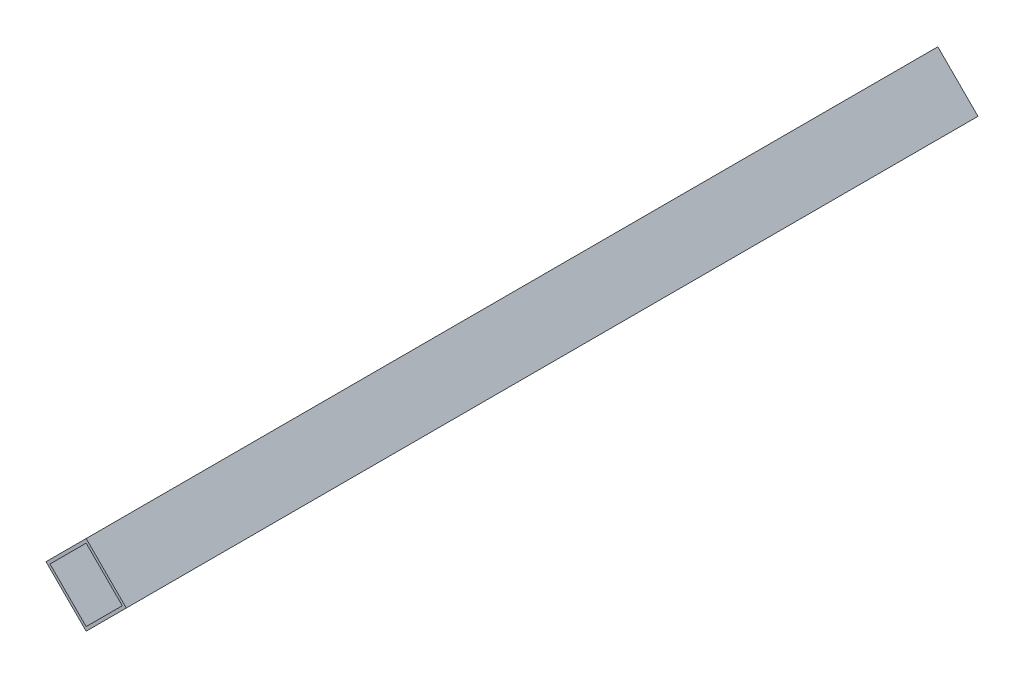
ISO-10303-21;
HEADER;
FILE_DESCRIPTION(('STEP AP214'),'2;1');
FILE_NAME('part.step','',(''),(''),'','','');
FILE_SCHEMA(('AUTOMOTIVE_DESIGN { 1 0 10303 214 1 1 1 1 }'));
ENDSEC;
DATA;
#1=APPLICATION_CONTEXT('core data for automotive mechanical design processes');
#2=APPLICATION_PROTOCOL_DEFINITION('international standard','automotive_design',2000,#1);
#3=PRODUCT_CONTEXT('',#1,'mechanical');
#4=PRODUCT('Part','Part','',(#3));
#5=PRODUCT_RELATED_PRODUCT_CATEGORY('part','',(#4));
#6=PRODUCT_DEFINITION_FORMATION('','',#4);
#7=PRODUCT_DEFINITION_CONTEXT('part definition',#1,'design');
#8=PRODUCT_DEFINITION('design','',#6,#7);
#9=PRODUCT_DEFINITION_SHAPE('','',#8);
#10=(LENGTH_UNIT() NAMED_UNIT(*) SI_UNIT(.MILLI.,.METRE.));
#11=(NAMED_UNIT(*) PLANE_ANGLE_UNIT() SI_UNIT($,.RADIAN.));
#12=(NAMED_UNIT(*) SI_UNIT($,.STERADIAN.) SOLID_ANGLE_UNIT());
#13=UNCERTAINTY_MEASURE_WITH_UNIT(LENGTH_MEASURE(1.E-05),#10,'distance_accuracy_value','');
#14=(GEOMETRIC_REPRESENTATION_CONTEXT(3) GLOBAL_UNCERTAINTY_ASSIGNED_CONTEXT((#13)) GLOBAL_UNIT_ASSIGNED_CONTEXT((#10,
#11,#12)) REPRESENTATION_CONTEXT('',''));
#15=CARTESIAN_POINT('',(0.,0.,0.));
#16=DIRECTION('',(0.,0.,1.));
#17=DIRECTION('',(1.,0.,0.));
#18=AXIS2_PLACEMENT_3D('',#15,#16,#17);
#19=CARTESIAN_POINT('',(0.,0.,300.));
#20=DIRECTION('',(0.,0.,1.));
#21=DIRECTION('',(1.,0.,0.));
#22=AXIS2_PLACEMENT_3D('',#19,#20,#21);
#23=PLANE('',#22);
#24=DIRECTION('',(0.707106781186544,0.707106781186551,0.));
#25=VECTOR('',#24,1.);
#26=CARTESIAN_POINT('',(1.472650518087E-13,-14.1421356237309,300.));
#27=LINE('',#26,#25);
#28=CARTESIAN_POINT('',(1.472650518087E-13,-14.1421356237309,300.));
#29=VERTEX_POINT('',#28);
#30=CARTESIAN_POINT('',(14.1421356237309,0.,300.));
#31=VERTEX_POINT('',#30);
#32=EDGE_CURVE('E140',#29,#31,#27,.T.);
#33=ORIENTED_EDGE('',*,*,#32,.T.);
#34=DIRECTION('',(-0.707106781186549,0.707106781186546,0.));
#35=VECTOR('',#34,1.);
#36=CARTESIAN_POINT('',(14.1421356237309,0.,300.));
#37=LINE('',#36,#35);
#38=CARTESIAN_POINT('',(0.,14.1421356237309,300.));
#39=VERTEX_POINT('',#38);
#40=EDGE_CURVE('E143',#31,#39,#37,.T.);
#41=ORIENTED_EDGE('',*,*,#40,.T.);
#42=DIRECTION('',(-0.707106781186544,-0.707106781186551,0.));
#43=VECTOR('',#42,1.);
#44=CARTESIAN_POINT('',(0.,14.1421356237309,300.));
#45=LINE('',#44,#43);
#46=CARTESIAN_POINT('',(-14.1421356237309,0.,300.));
#47=VERTEX_POINT('',#46);
#48=EDGE_CURVE('E146',#39,#47,#45,.T.);
#49=ORIENTED_EDGE('',*,*,#48,.T.);
#50=DIRECTION('',(0.707106781186554,-0.707106781186541,0.));
#51=VECTOR('',#50,1.);
#52=CARTESIAN_POINT('',(-14.1421356237309,0.,300.));
#53=LINE('',#52,#51);
#54=EDGE_CURVE('E148',#47,#29,#53,.T.);
#55=ORIENTED_EDGE('',*,*,#54,.T.);
#56=EDGE_LOOP('',(#33,#41,#49,#55));
#57=FACE_BOUND('',#56,.T.);
#58=DIRECTION('',(-0.707106781186544,0.707106781186551,0.));
#59=VECTOR('',#58,1.);
#60=CARTESIAN_POINT('',(12.7279220613579,0.,300.));
#61=LINE('',#60,#59);
#62=CARTESIAN_POINT('',(12.7279220613579,0.,300.));
#63=VERTEX_POINT('',#62);
#64=CARTESIAN_POINT('',(0.,12.7279220613578,300.));
#65=VERTEX_POINT('',#64);
#66=EDGE_CURVE('E110',#63,#65,#61,.T.);
#67=ORIENTED_EDGE('',*,*,#66,.F.);
#68=DIRECTION('',(0.707106781186552,0.707106781186543,0.));
#69=VECTOR('',#68,1.);
#70=CARTESIAN_POINT('',(0.,-12.7279220613579,300.));
#71=LINE('',#70,#69);
#72=CARTESIAN_POINT('',(0.,-12.7279220613579,300.));
#73=VERTEX_POINT('',#72);
#74=EDGE_CURVE('E102',#73,#63,#71,.T.);
#75=ORIENTED_EDGE('',*,*,#74,.F.);
#76=DIRECTION('',(0.707106781186543,-0.707106781186552,0.));
#77=VECTOR('',#76,1.);
#78=CARTESIAN_POINT('',(-12.7279220613578,0.,300.));
#79=LINE('',#78,#77);
#80=CARTESIAN_POINT('',(-12.7279220613578,0.,300.));
#81=VERTEX_POINT('',#80);
#82=EDGE_CURVE('E124',#81,#73,#79,.T.);
#83=ORIENTED_EDGE('',*,*,#82,.F.);
#84=DIRECTION('',(-0.707106781186552,-0.707106781186544,0.));
#85=VECTOR('',#84,1.);
#86=CARTESIAN_POINT('',(0.,12.7279220613578,300.));
#87=LINE('',#86,#85);
#88=EDGE_CURVE('E122',#65,#81,#87,.T.);
#89=ORIENTED_EDGE('',*,*,#88,.F.);
#90=EDGE_LOOP('',(#67,#75,#83,#89));
#91=FACE_BOUND('',#90,.T.);
#92=ADVANCED_FACE('F35',(#57,#91),#23,.T.);
#93=CARTESIAN_POINT('',(0.,0.,0.));
#94=DIRECTION('',(0.,0.,1.));
#95=DIRECTION('',(1.,0.,0.));
#96=AXIS2_PLACEMENT_3D('',#93,#94,#95);
#97=PLANE('',#96);
#98=DIRECTION('',(0.707106781186544,0.707106781186551,0.));
#99=VECTOR('',#98,1.);
#100=CARTESIAN_POINT('',(1.472650518087E-13,-14.1421356237309,0.));
#101=LINE('',#100,#99);
#102=CARTESIAN_POINT('',(1.472650518087E-13,-14.1421356237309,0.));
#103=VERTEX_POINT('',#102);
#104=CARTESIAN_POINT('',(14.1421356237309,0.,0.));
#105=VERTEX_POINT('',#104);
#106=EDGE_CURVE('E118',#103,#105,#101,.T.);
#107=ORIENTED_EDGE('',*,*,#106,.F.);
#108=DIRECTION('',(0.707106781186554,-0.707106781186541,0.));
#109=VECTOR('',#108,1.);
#110=CARTESIAN_POINT('',(-14.1421356237309,0.,0.));
#111=LINE('',#110,#109);
#112=CARTESIAN_POINT('',(-14.1421356237309,0.,0.));
#113=VERTEX_POINT('',#112);
#114=EDGE_CURVE('E144',#113,#103,#111,.T.);
#115=ORIENTED_EDGE('',*,*,#114,.F.);
#116=DIRECTION('',(-0.707106781186544,-0.707106781186551,0.));
#117=VECTOR('',#116,1.);
#118=CARTESIAN_POINT('',(0.,14.1421356237309,0.));
#119=LINE('',#118,#117);
#120=CARTESIAN_POINT('',(0.,14.1421356237309,0.));
#121=VERTEX_POINT('',#120);
#122=EDGE_CURVE('E155',#121,#113,#119,.T.);
#123=ORIENTED_EDGE('',*,*,#122,.F.);
#124=DIRECTION('',(-0.707106781186549,0.707106781186546,0.));
#125=VECTOR('',#124,1.);
#126=CARTESIAN_POINT('',(14.1421356237309,0.,0.));
#127=LINE('',#126,#125);
#128=EDGE_CURVE('E153',#105,#121,#127,.T.);
#129=ORIENTED_EDGE('',*,*,#128,.F.);
#130=EDGE_LOOP('',(#107,#115,#123,#129));
#131=FACE_BOUND('',#130,.T.);
#132=DIRECTION('',(0.707106781186552,0.707106781186543,0.));
#133=VECTOR('',#132,1.);
#134=CARTESIAN_POINT('',(0.,-12.7279220613579,0.));
#135=LINE('',#134,#133);
#136=CARTESIAN_POINT('',(0.,-12.7279220613579,0.));
#137=VERTEX_POINT('',#136);
#138=CARTESIAN_POINT('',(12.7279220613579,0.,0.));
#139=VERTEX_POINT('',#138);
#140=EDGE_CURVE('E60',#137,#139,#135,.T.);
#141=ORIENTED_EDGE('',*,*,#140,.T.);
#142=DIRECTION('',(-0.707106781186544,0.707106781186551,0.));
#143=VECTOR('',#142,1.);
#144=CARTESIAN_POINT('',(12.7279220613579,0.,0.));
#145=LINE('',#144,#143);
#146=CARTESIAN_POINT('',(0.,12.7279220613578,0.));
#147=VERTEX_POINT('',#146);
#148=EDGE_CURVE('E117',#139,#147,#145,.T.);
#149=ORIENTED_EDGE('',*,*,#148,.T.);
#150=DIRECTION('',(-0.707106781186552,-0.707106781186544,0.));
#151=VECTOR('',#150,1.);
#152=CARTESIAN_POINT('',(0.,12.7279220613578,0.));
#153=LINE('',#152,#151);
#154=CARTESIAN_POINT('',(-12.7279220613578,0.,0.));
#155=VERTEX_POINT('',#154);
#156=EDGE_CURVE('E132',#147,#155,#153,.T.);
#157=ORIENTED_EDGE('',*,*,#156,.T.);
#158=DIRECTION('',(0.707106781186543,-0.707106781186552,0.));
#159=VECTOR('',#158,1.);
#160=CARTESIAN_POINT('',(-12.7279220613578,0.,0.));
#161=LINE('',#160,#159);
#162=EDGE_CURVE('E111',#155,#137,#161,.T.);
#163=ORIENTED_EDGE('',*,*,#162,.T.);
#164=EDGE_LOOP('',(#141,#149,#157,#163));
#165=FACE_BOUND('',#164,.T.);
#166=ADVANCED_FACE('F228',(#131,#165),#97,.F.);
#167=CARTESIAN_POINT('',(1.472650518087E-13,-14.1421356237309,300.));
#168=DIRECTION('',(-0.707106781186551,0.707106781186544,0.));
#169=DIRECTION('',(-0.707106781186544,-0.707106781186551,0.));
#170=AXIS2_PLACEMENT_3D('',#167,#168,#169);
#171=PLANE('',#170);
#172=CARTESIAN_POINT('',(7.07106781186554,-7.07106781186546,290.));
#173=DIRECTION('',(0.707106781186551,-0.707106781186544,0.));
#174=DIRECTION('',(0.707106781186544,0.707106781186551,0.));
#175=AXIS2_PLACEMENT_3D('',#172,#173,#174);
#176=CIRCLE('',#175,0.999999999999998);
#177=CARTESIAN_POINT('',(7.77817459305208,-6.36396103067891,290.));
#178=VERTEX_POINT('',#177);
#179=EDGE_CURVE('E169',#178,#178,#176,.T.);
#180=ORIENTED_EDGE('',*,*,#179,.F.);
#181=EDGE_LOOP('',(#180));
#182=FACE_BOUND('',#181,.T.);
#183=CARTESIAN_POINT('',(7.07106781186554,-7.07106781186546,220.));
#184=DIRECTION('',(0.707106781186551,-0.707106781186544,0.));
#185=DIRECTION('',(0.707106781186544,0.707106781186551,0.));
#186=AXIS2_PLACEMENT_3D('',#183,#184,#185);
#187=CIRCLE('',#186,0.999999999999998);
#188=CARTESIAN_POINT('',(7.77817459305208,-6.36396103067891,220.));
#189=VERTEX_POINT('',#188);
#190=EDGE_CURVE('E329',#189,#189,#187,.T.);
#191=ORIENTED_EDGE('',*,*,#190,.F.);
#192=EDGE_LOOP('',(#191));
#193=FACE_BOUND('',#192,.T.);
#194=CARTESIAN_POINT('',(7.07106781186554,-7.07106781186546,150.));
#195=DIRECTION('',(0.707106781186551,-0.707106781186544,0.));
#196=DIRECTION('',(0.707106781186544,0.707106781186551,0.));
#197=AXIS2_PLACEMENT_3D('',#194,#195,#196);
#198=CIRCLE('',#197,0.999999999999998);
#199=CARTESIAN_POINT('',(7.77817459305208,-6.36396103067891,150.));
#200=VERTEX_POINT('',#199);
#201=EDGE_CURVE('E327',#200,#200,#198,.T.);
#202=ORIENTED_EDGE('',*,*,#201,.F.);
#203=EDGE_LOOP('',(#202));
#204=FACE_BOUND('',#203,.T.);
#205=CARTESIAN_POINT('',(7.07106781186554,-7.07106781186546,80.));
#206=DIRECTION('',(0.707106781186551,-0.707106781186544,0.));
#207=DIRECTION('',(0.707106781186544,0.707106781186551,0.));
#208=AXIS2_PLACEMENT_3D('',#205,#206,#207);
#209=CIRCLE('',#208,0.999999999999998);
#210=CARTESIAN_POINT('',(7.77817459305208,-6.36396103067891,80.));
#211=VERTEX_POINT('',#210);
#212=EDGE_CURVE('E325',#211,#211,#209,.T.);
#213=ORIENTED_EDGE('',*,*,#212,.F.);
#214=EDGE_LOOP('',(#213));
#215=FACE_BOUND('',#214,.T.);
#216=CARTESIAN_POINT('',(7.07106781186554,-7.07106781186546,9.99999999999995));
#217=DIRECTION('',(0.707106781186551,-0.707106781186544,0.));
#218=DIRECTION('',(0.707106781186544,0.707106781186551,0.));
#219=AXIS2_PLACEMENT_3D('',#216,#217,#218);
#220=CIRCLE('',#219,0.999999999999998);
#221=CARTESIAN_POINT('',(7.77817459305208,-6.36396103067891,9.99999999999995));
#222=VERTEX_POINT('',#221);
#223=EDGE_CURVE('E300',#222,#222,#220,.T.);
#224=ORIENTED_EDGE('',*,*,#223,.F.);
#225=EDGE_LOOP('',(#224));
#226=FACE_BOUND('',#225,.T.);
#227=ORIENTED_EDGE('',*,*,#106,.T.);
#228=DIRECTION('',(0.,0.,-1.));
#229=VECTOR('',#228,1.);
#230=CARTESIAN_POINT('',(14.1421356237309,0.,300.));
#231=LINE('',#230,#229);
#232=EDGE_CURVE('E11',#31,#105,#231,.T.);
#233=ORIENTED_EDGE('',*,*,#232,.F.);
#234=ORIENTED_EDGE('',*,*,#32,.F.);
#235=DIRECTION('',(0.,0.,-1.));
#236=VECTOR('',#235,1.);
#237=CARTESIAN_POINT('',(1.472650518087E-13,-14.1421356237309,300.));
#238=LINE('',#237,#236);
#239=EDGE_CURVE('E150',#29,#103,#238,.T.);
#240=ORIENTED_EDGE('',*,*,#239,.T.);
#241=EDGE_LOOP('',(#227,#233,#234,#240));
#242=FACE_BOUND('',#241,.T.);
#243=ADVANCED_FACE('F37',(#182,#193,#204,#215,#226,#242),#171,.F.);
#244=CARTESIAN_POINT('',(14.1421356237309,0.,300.));
#245=DIRECTION('',(-0.707106781186546,-0.707106781186549,0.));
#246=DIRECTION('',(0.707106781186549,-0.707106781186546,0.));
#247=AXIS2_PLACEMENT_3D('',#244,#245,#246);
#248=PLANE('',#247);
#249=ORIENTED_EDGE('',*,*,#128,.T.);
#250=DIRECTION('',(0.,0.,-1.));
#251=VECTOR('',#250,1.);
#252=CARTESIAN_POINT('',(0.,14.1421356237309,300.));
#253=LINE('',#252,#251);
#254=EDGE_CURVE('E44',#39,#121,#253,.T.);
#255=ORIENTED_EDGE('',*,*,#254,.F.);
#256=ORIENTED_EDGE('',*,*,#40,.F.);
#257=ORIENTED_EDGE('',*,*,#232,.T.);
#258=EDGE_LOOP('',(#249,#255,#256,#257));
#259=FACE_BOUND('',#258,.T.);
#260=ADVANCED_FACE('F244',(#259),#248,.F.);
#261=CARTESIAN_POINT('',(0.,14.1421356237309,300.));
#262=DIRECTION('',(0.707106781186551,-0.707106781186544,0.));
#263=DIRECTION('',(0.707106781186544,0.707106781186551,0.));
#264=AXIS2_PLACEMENT_3D('',#261,#262,#263);
#265=PLANE('',#264);
#266=CARTESIAN_POINT('',(-7.07106781186549,7.07106781186541,290.));
#267=DIRECTION('',(0.707106781186551,-0.707106781186544,0.));
#268=DIRECTION('',(0.707106781186544,0.707106781186551,0.));
#269=AXIS2_PLACEMENT_3D('',#266,#267,#268);
#270=CIRCLE('',#269,0.999999999999998);
#271=CARTESIAN_POINT('',(-6.36396103067894,7.77817459305196,290.));
#272=VERTEX_POINT('',#271);
#273=EDGE_CURVE('E130',#272,#272,#270,.T.);
#274=ORIENTED_EDGE('',*,*,#273,.T.);
#275=EDGE_LOOP('',(#274));
#276=FACE_BOUND('',#275,.T.);
#277=CARTESIAN_POINT('',(-7.07106781186549,7.07106781186541,220.));
#278=DIRECTION('',(0.707106781186551,-0.707106781186544,0.));
#279=DIRECTION('',(0.707106781186544,0.707106781186551,0.));
#280=AXIS2_PLACEMENT_3D('',#277,#278,#279);
#281=CIRCLE('',#280,0.999999999999998);
#282=CARTESIAN_POINT('',(-6.36396103067894,7.77817459305196,220.));
#283=VERTEX_POINT('',#282);
#284=EDGE_CURVE('E186',#283,#283,#281,.T.);
#285=ORIENTED_EDGE('',*,*,#284,.T.);
#286=EDGE_LOOP('',(#285));
#287=FACE_BOUND('',#286,.T.);
#288=CARTESIAN_POINT('',(-7.07106781186549,7.07106781186541,150.));
#289=DIRECTION('',(0.707106781186551,-0.707106781186544,0.));
#290=DIRECTION('',(0.707106781186544,0.707106781186551,0.));
#291=AXIS2_PLACEMENT_3D('',#288,#289,#290);
#292=CIRCLE('',#291,0.999999999999998);
#293=CARTESIAN_POINT('',(-6.36396103067894,7.77817459305196,150.));
#294=VERTEX_POINT('',#293);
#295=EDGE_CURVE('E182',#294,#294,#292,.T.);
#296=ORIENTED_EDGE('',*,*,#295,.T.);
#297=EDGE_LOOP('',(#296));
#298=FACE_BOUND('',#297,.T.);
#299=CARTESIAN_POINT('',(-7.07106781186549,7.07106781186541,80.));
#300=DIRECTION('',(0.707106781186551,-0.707106781186544,0.));
#301=DIRECTION('',(0.707106781186544,0.707106781186551,0.));
#302=AXIS2_PLACEMENT_3D('',#299,#300,#301);
#303=CIRCLE('',#302,0.999999999999998);
#304=CARTESIAN_POINT('',(-6.36396103067894,7.77817459305196,80.));
#305=VERTEX_POINT('',#304);
#306=EDGE_CURVE('E178',#305,#305,#303,.T.);
#307=ORIENTED_EDGE('',*,*,#306,.T.);
#308=EDGE_LOOP('',(#307));
#309=FACE_BOUND('',#308,.T.);
#310=CARTESIAN_POINT('',(-7.07106781186549,7.07106781186541,9.99999999999995));
#311=DIRECTION('',(0.707106781186551,-0.707106781186544,0.));
#312=DIRECTION('',(0.707106781186544,0.707106781186551,0.));
#313=AXIS2_PLACEMENT_3D('',#310,#311,#312);
#314=CIRCLE('',#313,0.999999999999998);
#315=CARTESIAN_POINT('',(-6.36396103067894,7.77817459305196,9.99999999999995));
#316=VERTEX_POINT('',#315);
#317=EDGE_CURVE('E174',#316,#316,#314,.T.);
#318=ORIENTED_EDGE('',*,*,#317,.T.);
#319=EDGE_LOOP('',(#318));
#320=FACE_BOUND('',#319,.T.);
#321=ORIENTED_EDGE('',*,*,#122,.T.);
#322=DIRECTION('',(0.,0.,-1.));
#323=VECTOR('',#322,1.);
#324=CARTESIAN_POINT('',(-14.1421356237309,0.,300.));
#325=LINE('',#324,#323);
#326=EDGE_CURVE('E160',#47,#113,#325,.T.);
#327=ORIENTED_EDGE('',*,*,#326,.F.);
#328=ORIENTED_EDGE('',*,*,#48,.F.);
#329=ORIENTED_EDGE('',*,*,#254,.T.);
#330=EDGE_LOOP('',(#321,#327,#328,#329));
#331=FACE_BOUND('',#330,.T.);
#332=ADVANCED_FACE('F203',(#276,#287,#298,#309,#320,#331),#265,.F.);
#333=CARTESIAN_POINT('',(-14.1421356237309,0.,300.));
#334=DIRECTION('',(0.707106781186541,0.707106781186554,0.));
#335=DIRECTION('',(-0.707106781186554,0.707106781186541,0.));
#336=AXIS2_PLACEMENT_3D('',#333,#334,#335);
#337=PLANE('',#336);
#338=ORIENTED_EDGE('',*,*,#114,.T.);
#339=ORIENTED_EDGE('',*,*,#239,.F.);
#340=ORIENTED_EDGE('',*,*,#54,.F.);
#341=ORIENTED_EDGE('',*,*,#326,.T.);
#342=EDGE_LOOP('',(#338,#339,#340,#341));
#343=FACE_BOUND('',#342,.T.);
#344=ADVANCED_FACE('F239',(#343),#337,.F.);
#345=CARTESIAN_POINT('',(0.,-12.7279220613579,300.));
#346=DIRECTION('',(-0.707106781186543,0.707106781186552,0.));
#347=DIRECTION('',(-0.707106781186552,-0.707106781186543,0.));
#348=AXIS2_PLACEMENT_3D('',#345,#346,#347);
#349=PLANE('',#348);
#350=CARTESIAN_POINT('',(6.36396103067896,-6.36396103067889,290.));
#351=DIRECTION('',(-0.707106781186543,0.707106781186552,0.));
#352=DIRECTION('',(-0.707106781186552,-0.707106781186543,0.));
#353=AXIS2_PLACEMENT_3D('',#350,#351,#352);
#354=CIRCLE('',#353,0.999999999999998);
#355=CARTESIAN_POINT('',(5.65685424949241,-7.07106781186544,290.));
#356=VERTEX_POINT('',#355);
#357=EDGE_CURVE('E198',#356,#356,#354,.T.);
#358=ORIENTED_EDGE('',*,*,#357,.F.);
#359=EDGE_LOOP('',(#358));
#360=FACE_BOUND('',#359,.T.);
#361=CARTESIAN_POINT('',(6.36396103067896,-6.36396103067889,220.));
#362=DIRECTION('',(-0.707106781186543,0.707106781186552,0.));
#363=DIRECTION('',(-0.707106781186552,-0.707106781186543,0.));
#364=AXIS2_PLACEMENT_3D('',#361,#362,#363);
#365=CIRCLE('',#364,0.999999999999998);
#366=CARTESIAN_POINT('',(5.65685424949241,-7.07106781186544,220.));
#367=VERTEX_POINT('',#366);
#368=EDGE_CURVE('E181',#367,#367,#365,.T.);
#369=ORIENTED_EDGE('',*,*,#368,.F.);
#370=EDGE_LOOP('',(#369));
#371=FACE_BOUND('',#370,.T.);
#372=CARTESIAN_POINT('',(6.36396103067896,-6.36396103067889,150.));
#373=DIRECTION('',(-0.707106781186543,0.707106781186552,0.));
#374=DIRECTION('',(-0.707106781186552,-0.707106781186543,0.));
#375=AXIS2_PLACEMENT_3D('',#372,#373,#374);
#376=CIRCLE('',#375,0.999999999999998);
#377=CARTESIAN_POINT('',(5.65685424949241,-7.07106781186544,150.));
#378=VERTEX_POINT('',#377);
#379=EDGE_CURVE('E177',#378,#378,#376,.T.);
#380=ORIENTED_EDGE('',*,*,#379,.F.);
#381=EDGE_LOOP('',(#380));
#382=FACE_BOUND('',#381,.T.);
#383=CARTESIAN_POINT('',(6.36396103067896,-6.36396103067889,80.));
#384=DIRECTION('',(-0.707106781186543,0.707106781186552,0.));
#385=DIRECTION('',(-0.707106781186552,-0.707106781186543,0.));
#386=AXIS2_PLACEMENT_3D('',#383,#384,#385);
#387=CIRCLE('',#386,0.999999999999998);
#388=CARTESIAN_POINT('',(5.65685424949241,-7.07106781186544,80.));
#389=VERTEX_POINT('',#388);
#390=EDGE_CURVE('E173',#389,#389,#387,.T.);
#391=ORIENTED_EDGE('',*,*,#390,.F.);
#392=EDGE_LOOP('',(#391));
#393=FACE_BOUND('',#392,.T.);
#394=CARTESIAN_POINT('',(6.36396103067896,-6.36396103067889,9.99999999999995));
#395=DIRECTION('',(-0.707106781186543,0.707106781186552,0.));
#396=DIRECTION('',(-0.707106781186552,-0.707106781186543,0.));
#397=AXIS2_PLACEMENT_3D('',#394,#395,#396);
#398=CIRCLE('',#397,0.999999999999998);
#399=CARTESIAN_POINT('',(5.65685424949241,-7.07106781186544,9.99999999999995));
#400=VERTEX_POINT('',#399);
#401=EDGE_CURVE('E168',#400,#400,#398,.T.);
#402=ORIENTED_EDGE('',*,*,#401,.F.);
#403=EDGE_LOOP('',(#402));
#404=FACE_BOUND('',#403,.T.);
#405=ORIENTED_EDGE('',*,*,#140,.F.);
#406=DIRECTION('',(0.,0.,-1.));
#407=VECTOR('',#406,1.);
#408=CARTESIAN_POINT('',(0.,-12.7279220613579,300.));
#409=LINE('',#408,#407);
#410=EDGE_CURVE('E106',#73,#137,#409,.T.);
#411=ORIENTED_EDGE('',*,*,#410,.F.);
#412=ORIENTED_EDGE('',*,*,#74,.T.);
#413=DIRECTION('',(0.,0.,-1.));
#414=VECTOR('',#413,1.);
#415=CARTESIAN_POINT('',(12.7279220613579,0.,300.));
#416=LINE('',#415,#414);
#417=EDGE_CURVE('E105',#63,#139,#416,.T.);
#418=ORIENTED_EDGE('',*,*,#417,.T.);
#419=EDGE_LOOP('',(#405,#411,#412,#418));
#420=FACE_BOUND('',#419,.T.);
#421=ADVANCED_FACE('F104',(#360,#371,#382,#393,#404,#420),#349,.T.);
#422=CARTESIAN_POINT('',(12.7279220613579,0.,300.));
#423=DIRECTION('',(-0.707106781186551,-0.707106781186544,0.));
#424=DIRECTION('',(0.707106781186544,-0.707106781186551,0.));
#425=AXIS2_PLACEMENT_3D('',#422,#423,#424);
#426=PLANE('',#425);
#427=ORIENTED_EDGE('',*,*,#148,.F.);
#428=ORIENTED_EDGE('',*,*,#417,.F.);
#429=ORIENTED_EDGE('',*,*,#66,.T.);
#430=DIRECTION('',(0.,0.,-1.));
#431=VECTOR('',#430,1.);
#432=CARTESIAN_POINT('',(0.,12.7279220613578,300.));
#433=LINE('',#432,#431);
#434=EDGE_CURVE('E119',#65,#147,#433,.T.);
#435=ORIENTED_EDGE('',*,*,#434,.T.);
#436=EDGE_LOOP('',(#427,#428,#429,#435));
#437=FACE_BOUND('',#436,.T.);
#438=ADVANCED_FACE('F114',(#437),#426,.T.);
#439=CARTESIAN_POINT('',(0.,12.7279220613578,300.));
#440=DIRECTION('',(0.707106781186543,-0.707106781186552,0.));
#441=DIRECTION('',(0.707106781186552,0.707106781186543,0.));
#442=AXIS2_PLACEMENT_3D('',#439,#440,#441);
#443=PLANE('',#442);
#444=CARTESIAN_POINT('',(-6.36396103067896,6.36396103067889,290.));
#445=DIRECTION('',(0.707106781186543,-0.707106781186552,0.));
#446=DIRECTION('',(0.707106781186552,0.707106781186543,0.));
#447=AXIS2_PLACEMENT_3D('',#444,#445,#446);
#448=CIRCLE('',#447,0.999999999999998);
#449=CARTESIAN_POINT('',(-5.65685424949241,7.07106781186543,290.));
#450=VERTEX_POINT('',#449);
#451=EDGE_CURVE('E39',#450,#450,#448,.T.);
#452=ORIENTED_EDGE('',*,*,#451,.F.);
#453=EDGE_LOOP('',(#452));
#454=FACE_BOUND('',#453,.T.);
#455=CARTESIAN_POINT('',(-6.36396103067896,6.36396103067889,220.));
#456=DIRECTION('',(0.707106781186543,-0.707106781186552,0.));
#457=DIRECTION('',(0.707106781186552,0.707106781186543,0.));
#458=AXIS2_PLACEMENT_3D('',#455,#456,#457);
#459=CIRCLE('',#458,0.999999999999998);
#460=CARTESIAN_POINT('',(-5.65685424949241,7.07106781186543,220.));
#461=VERTEX_POINT('',#460);
#462=EDGE_CURVE('E179',#461,#461,#459,.T.);
#463=ORIENTED_EDGE('',*,*,#462,.F.);
#464=EDGE_LOOP('',(#463));
#465=FACE_BOUND('',#464,.T.);
#466=CARTESIAN_POINT('',(-6.36396103067896,6.36396103067889,150.));
#467=DIRECTION('',(0.707106781186543,-0.707106781186552,0.));
#468=DIRECTION('',(0.707106781186552,0.707106781186543,0.));
#469=AXIS2_PLACEMENT_3D('',#466,#467,#468);
#470=CIRCLE('',#469,0.999999999999998);
#471=CARTESIAN_POINT('',(-5.65685424949241,7.07106781186543,150.));
#472=VERTEX_POINT('',#471);
#473=EDGE_CURVE('E175',#472,#472,#470,.T.);
#474=ORIENTED_EDGE('',*,*,#473,.F.);
#475=EDGE_LOOP('',(#474));
#476=FACE_BOUND('',#475,.T.);
#477=CARTESIAN_POINT('',(-6.36396103067896,6.36396103067889,80.));
#478=DIRECTION('',(0.707106781186543,-0.707106781186552,0.));
#479=DIRECTION('',(0.707106781186552,0.707106781186543,0.));
#480=AXIS2_PLACEMENT_3D('',#477,#478,#479);
#481=CIRCLE('',#480,0.999999999999998);
#482=CARTESIAN_POINT('',(-5.65685424949241,7.07106781186543,80.));
#483=VERTEX_POINT('',#482);
#484=EDGE_CURVE('E170',#483,#483,#481,.T.);
#485=ORIENTED_EDGE('',*,*,#484,.F.);
#486=EDGE_LOOP('',(#485));
#487=FACE_BOUND('',#486,.T.);
#488=CARTESIAN_POINT('',(-6.36396103067896,6.36396103067889,9.99999999999995));
#489=DIRECTION('',(0.707106781186543,-0.707106781186552,0.));
#490=DIRECTION('',(0.707106781186552,0.707106781186543,0.));
#491=AXIS2_PLACEMENT_3D('',#488,#489,#490);
#492=CIRCLE('',#491,0.999999999999998);
#493=CARTESIAN_POINT('',(-5.65685424949241,7.07106781186543,9.99999999999995));
#494=VERTEX_POINT('',#493);
#495=EDGE_CURVE('E165',#494,#494,#492,.T.);
#496=ORIENTED_EDGE('',*,*,#495,.F.);
#497=EDGE_LOOP('',(#496));
#498=FACE_BOUND('',#497,.T.);
#499=ORIENTED_EDGE('',*,*,#156,.F.);
#500=ORIENTED_EDGE('',*,*,#434,.F.);
#501=ORIENTED_EDGE('',*,*,#88,.T.);
#502=DIRECTION('',(0.,0.,-1.));
#503=VECTOR('',#502,1.);
#504=CARTESIAN_POINT('',(-12.7279220613578,0.,300.));
#505=LINE('',#504,#503);
#506=EDGE_CURVE('E52',#81,#155,#505,.T.);
#507=ORIENTED_EDGE('',*,*,#506,.T.);
#508=EDGE_LOOP('',(#499,#500,#501,#507));
#509=FACE_BOUND('',#508,.T.);
#510=ADVANCED_FACE('F267',(#454,#465,#476,#487,#498,#509),#443,.T.);
#511=CARTESIAN_POINT('',(-12.7279220613578,0.,300.));
#512=DIRECTION('',(0.707106781186552,0.707106781186543,0.));
#513=DIRECTION('',(-0.707106781186543,0.707106781186552,0.));
#514=AXIS2_PLACEMENT_3D('',#511,#512,#513);
#515=PLANE('',#514);
#516=ORIENTED_EDGE('',*,*,#162,.F.);
#517=ORIENTED_EDGE('',*,*,#506,.F.);
#518=ORIENTED_EDGE('',*,*,#82,.T.);
#519=ORIENTED_EDGE('',*,*,#410,.T.);
#520=EDGE_LOOP('',(#516,#517,#518,#519));
#521=FACE_BOUND('',#520,.T.);
#522=ADVANCED_FACE('F265',(#521),#515,.T.);
#523=CARTESIAN_POINT('',(-14.142135623731,14.1421356237309,9.99999999999995));
#524=DIRECTION('',(0.707106781186551,-0.707106781186544,0.));
#525=DIRECTION('',(0.707106781186544,0.707106781186551,0.));
#526=AXIS2_PLACEMENT_3D('',#523,#524,#525);
#527=CYLINDRICAL_SURFACE('',#526,0.999999999999998);
#528=ORIENTED_EDGE('',*,*,#495,.T.);
#529=EDGE_LOOP('',(#528));
#530=FACE_BOUND('',#529,.T.);
#531=ORIENTED_EDGE('',*,*,#317,.F.);
#532=EDGE_LOOP('',(#531));
#533=FACE_BOUND('',#532,.T.);
#534=ADVANCED_FACE('F220',(#530,#533),#527,.F.);
#535=CARTESIAN_POINT('',(-14.142135623731,14.1421356237309,80.));
#536=DIRECTION('',(0.707106781186551,-0.707106781186544,0.));
#537=DIRECTION('',(0.707106781186544,0.707106781186551,0.));
#538=AXIS2_PLACEMENT_3D('',#535,#536,#537);
#539=CYLINDRICAL_SURFACE('',#538,0.999999999999998);
#540=ORIENTED_EDGE('',*,*,#484,.T.);
#541=EDGE_LOOP('',(#540));
#542=FACE_BOUND('',#541,.T.);
#543=ORIENTED_EDGE('',*,*,#306,.F.);
#544=EDGE_LOOP('',(#543));
#545=FACE_BOUND('',#544,.T.);
#546=ADVANCED_FACE('F273',(#542,#545),#539,.F.);
#547=CARTESIAN_POINT('',(-14.142135623731,14.1421356237309,150.));
#548=DIRECTION('',(0.707106781186551,-0.707106781186544,0.));
#549=DIRECTION('',(0.707106781186544,0.707106781186551,0.));
#550=AXIS2_PLACEMENT_3D('',#547,#548,#549);
#551=CYLINDRICAL_SURFACE('',#550,0.999999999999998);
#552=ORIENTED_EDGE('',*,*,#473,.T.);
#553=EDGE_LOOP('',(#552));
#554=FACE_BOUND('',#553,.T.);
#555=ORIENTED_EDGE('',*,*,#295,.F.);
#556=EDGE_LOOP('',(#555));
#557=FACE_BOUND('',#556,.T.);
#558=ADVANCED_FACE('F221',(#554,#557),#551,.F.);
#559=CARTESIAN_POINT('',(-14.142135623731,14.1421356237309,220.));
#560=DIRECTION('',(0.707106781186551,-0.707106781186544,0.));
#561=DIRECTION('',(0.707106781186544,0.707106781186551,0.));
#562=AXIS2_PLACEMENT_3D('',#559,#560,#561);
#563=CYLINDRICAL_SURFACE('',#562,0.999999999999998);
#564=ORIENTED_EDGE('',*,*,#462,.T.);
#565=EDGE_LOOP('',(#564));
#566=FACE_BOUND('',#565,.T.);
#567=ORIENTED_EDGE('',*,*,#284,.F.);
#568=EDGE_LOOP('',(#567));
#569=FACE_BOUND('',#568,.T.);
#570=ADVANCED_FACE('F209',(#566,#569),#563,.F.);
#571=CARTESIAN_POINT('',(-14.142135623731,14.1421356237309,290.));
#572=DIRECTION('',(0.707106781186551,-0.707106781186544,0.));
#573=DIRECTION('',(0.707106781186544,0.707106781186551,0.));
#574=AXIS2_PLACEMENT_3D('',#571,#572,#573);
#575=CYLINDRICAL_SURFACE('',#574,0.999999999999998);
#576=ORIENTED_EDGE('',*,*,#451,.T.);
#577=EDGE_LOOP('',(#576));
#578=FACE_BOUND('',#577,.T.);
#579=ORIENTED_EDGE('',*,*,#273,.F.);
#580=EDGE_LOOP('',(#579));
#581=FACE_BOUND('',#580,.T.);
#582=ADVANCED_FACE('F206',(#578,#581),#575,.F.);
#583=ORIENTED_EDGE('',*,*,#401,.T.);
#584=EDGE_LOOP('',(#583));
#585=FACE_BOUND('',#584,.T.);
#586=ORIENTED_EDGE('',*,*,#223,.T.);
#587=EDGE_LOOP('',(#586));
#588=FACE_BOUND('',#587,.T.);
#589=ADVANCED_FACE('F208',(#585,#588),#527,.F.);
#590=ORIENTED_EDGE('',*,*,#390,.T.);
#591=EDGE_LOOP('',(#590));
#592=FACE_BOUND('',#591,.T.);
#593=ORIENTED_EDGE('',*,*,#212,.T.);
#594=EDGE_LOOP('',(#593));
#595=FACE_BOUND('',#594,.T.);
#596=ADVANCED_FACE('F217',(#592,#595),#539,.F.);
#597=ORIENTED_EDGE('',*,*,#379,.T.);
#598=EDGE_LOOP('',(#597));
#599=FACE_BOUND('',#598,.T.);
#600=ORIENTED_EDGE('',*,*,#201,.T.);
#601=EDGE_LOOP('',(#600));
#602=FACE_BOUND('',#601,.T.);
#603=ADVANCED_FACE('F315',(#599,#602),#551,.F.);
#604=ORIENTED_EDGE('',*,*,#368,.T.);
#605=EDGE_LOOP('',(#604));
#606=FACE_BOUND('',#605,.T.);
#607=ORIENTED_EDGE('',*,*,#190,.T.);
#608=EDGE_LOOP('',(#607));
#609=FACE_BOUND('',#608,.T.);
#610=ADVANCED_FACE('F223',(#606,#609),#563,.F.);
#611=ORIENTED_EDGE('',*,*,#357,.T.);
#612=EDGE_LOOP('',(#611));
#613=FACE_BOUND('',#612,.T.);
#614=ORIENTED_EDGE('',*,*,#179,.T.);
#615=EDGE_LOOP('',(#614));
#616=FACE_BOUND('',#615,.T.);
#617=ADVANCED_FACE('F212',(#613,#616),#575,.F.);
#618=CLOSED_SHELL('',(#92,#166,#243,#260,#332,#344,#421,#438,#510,#522,#534,#546,#558,#570,#582,
#589,#596,#603,#610,#617));
#619=MANIFOLD_SOLID_BREP('B2',#618);
#620=ADVANCED_BREP_SHAPE_REPRESENTATION('',(#18,#619),#14);
#621=SHAPE_DEFINITION_REPRESENTATION(#9,#620);
ENDSEC;
END-ISO-10303-21;
